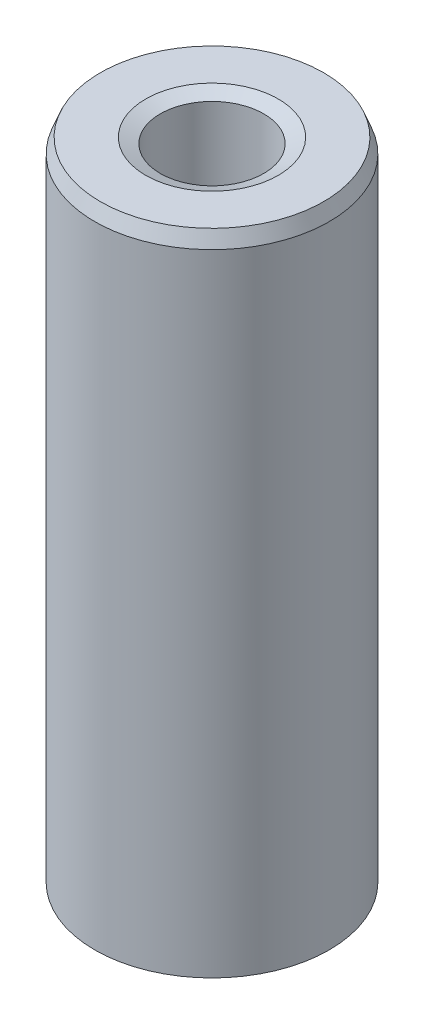
ISO-10303-21;
HEADER;
FILE_DESCRIPTION(('STEP AP214'),'2;1');
FILE_NAME('part.step','',(''),(''),'','','');
FILE_SCHEMA(('AUTOMOTIVE_DESIGN { 1 0 10303 214 1 1 1 1 }'));
ENDSEC;
DATA;
#1=APPLICATION_CONTEXT('core data for automotive mechanical design processes');
#2=APPLICATION_PROTOCOL_DEFINITION('international standard','automotive_design',2000,#1);
#3=PRODUCT_CONTEXT('',#1,'mechanical');
#4=PRODUCT('Part','Part','',(#3));
#5=PRODUCT_RELATED_PRODUCT_CATEGORY('part','',(#4));
#6=PRODUCT_DEFINITION_FORMATION('','',#4);
#7=PRODUCT_DEFINITION_CONTEXT('part definition',#1,'design');
#8=PRODUCT_DEFINITION('design','',#6,#7);
#9=PRODUCT_DEFINITION_SHAPE('','',#8);
#10=(LENGTH_UNIT() NAMED_UNIT(*) SI_UNIT(.MILLI.,.METRE.));
#11=(NAMED_UNIT(*) PLANE_ANGLE_UNIT() SI_UNIT($,.RADIAN.));
#12=(NAMED_UNIT(*) SI_UNIT($,.STERADIAN.) SOLID_ANGLE_UNIT());
#13=UNCERTAINTY_MEASURE_WITH_UNIT(LENGTH_MEASURE(1.E-05),#10,'distance_accuracy_value','');
#14=(GEOMETRIC_REPRESENTATION_CONTEXT(3) GLOBAL_UNCERTAINTY_ASSIGNED_CONTEXT((#13)) GLOBAL_UNIT_ASSIGNED_CONTEXT((#10,
#11,#12)) REPRESENTATION_CONTEXT('',''));
#15=CARTESIAN_POINT('',(0.,0.,0.));
#16=DIRECTION('',(0.,0.,1.));
#17=DIRECTION('',(1.,0.,0.));
#18=AXIS2_PLACEMENT_3D('',#15,#16,#17);
#19=CARTESIAN_POINT('',(0.,55.4875220967397,0.));
#20=DIRECTION('',(0.,-1.,0.));
#21=DIRECTION('',(0.,0.,-1.));
#22=AXIS2_PLACEMENT_3D('',#19,#20,#21);
#23=CYLINDRICAL_SURFACE('',#22,10.);
#24=CARTESIAN_POINT('',(0.,0.478369418327185,0.));
#25=DIRECTION('',(0.,1.,0.));
#26=DIRECTION('',(0.,0.,1.));
#27=AXIS2_PLACEMENT_3D('',#24,#25,#26);
#28=CIRCLE('',#27,10.);
#29=CARTESIAN_POINT('',(0.,0.478369418327178,-10.));
#30=VERTEX_POINT('',#29);
#31=EDGE_CURVE('E10',#30,#30,#28,.T.);
#32=CARTESIAN_POINT('',(0.,54.249934161855,0.));
#33=DIRECTION('',(0.,1.,0.));
#34=DIRECTION('',(0.,0.,1.));
#35=AXIS2_PLACEMENT_3D('',#32,#33,#34);
#36=CIRCLE('',#35,10.);
#37=CARTESIAN_POINT('',(0.,54.249934161855,-10.));
#38=VERTEX_POINT('',#37);
#39=EDGE_CURVE('E50',#38,#38,#36,.F.);
#40=CARTESIAN_POINT('',(0.,0.478369418327178,-10.));
#41=CARTESIAN_POINT('',(0.,1.03848988440559,-10.));
#42=CARTESIAN_POINT('',(0.,1.59861035048401,-10.));
#43=CARTESIAN_POINT('',(0.,2.71885128264084,-10.));
#44=CARTESIAN_POINT('',(0.,3.27897174871925,-10.));
#45=CARTESIAN_POINT('',(0.,4.39921268087608,-10.));
#46=CARTESIAN_POINT('',(0.,4.9593331469545,-10.));
#47=CARTESIAN_POINT('',(0.,6.07957407911133,-10.));
#48=CARTESIAN_POINT('',(0.,6.63969454518974,-10.));
#49=CARTESIAN_POINT('',(0.,7.75993547734657,-10.));
#50=CARTESIAN_POINT('',(0.,8.32005594342499,-10.));
#51=CARTESIAN_POINT('',(0.,9.44029687558182,-10.));
#52=CARTESIAN_POINT('',(0.,10.0004173416602,-10.));
#53=CARTESIAN_POINT('',(0.,11.1206582738171,-10.));
#54=CARTESIAN_POINT('',(0.,11.6807787398955,-10.));
#55=CARTESIAN_POINT('',(0.,12.8010196720523,-10.));
#56=CARTESIAN_POINT('',(0.,13.3611401381307,-10.));
#57=CARTESIAN_POINT('',(0.,14.4813810702876,-10.));
#58=CARTESIAN_POINT('',(0.,15.041501536366,-10.));
#59=CARTESIAN_POINT('',(0.,16.1617424685228,-10.));
#60=CARTESIAN_POINT('',(0.,16.7218629346012,-10.));
#61=CARTESIAN_POINT('',(0.,17.842103866758,-10.));
#62=CARTESIAN_POINT('',(0.,18.4022243328365,-10.));
#63=CARTESIAN_POINT('',(0.,19.5224652649933,-10.));
#64=CARTESIAN_POINT('',(0.,20.0825857310717,-10.));
#65=CARTESIAN_POINT('',(0.,21.2028266632285,-10.));
#66=CARTESIAN_POINT('',(0.,21.7629471293069,-10.));
#67=CARTESIAN_POINT('',(0.,22.8831880614638,-10.));
#68=CARTESIAN_POINT('',(0.,23.4433085275422,-10.));
#69=CARTESIAN_POINT('',(0.,24.563549459699,-10.));
#70=CARTESIAN_POINT('',(0.,25.1236699257774,-10.));
#71=CARTESIAN_POINT('',(0.,26.2439108579343,-10.));
#72=CARTESIAN_POINT('',(0.,26.8040313240127,-10.));
#73=CARTESIAN_POINT('',(0.,27.9242722561695,-10.));
#74=CARTESIAN_POINT('',(0.,28.4843927222479,-10.));
#75=CARTESIAN_POINT('',(0.,29.6046336544048,-10.));
#76=CARTESIAN_POINT('',(0.,30.1647541204832,-10.));
#77=CARTESIAN_POINT('',(0.,31.28499505264,-10.));
#78=CARTESIAN_POINT('',(0.,31.8451155187184,-10.));
#79=CARTESIAN_POINT('',(0.,32.9653564508752,-10.));
#80=CARTESIAN_POINT('',(0.,33.5254769169537,-10.));
#81=CARTESIAN_POINT('',(0.,34.6457178491105,-10.));
#82=CARTESIAN_POINT('',(0.,35.2058383151889,-10.));
#83=CARTESIAN_POINT('',(0.,36.3260792473457,-10.));
#84=CARTESIAN_POINT('',(0.,36.8861997134241,-10.));
#85=CARTESIAN_POINT('',(0.,38.006440645581,-10.));
#86=CARTESIAN_POINT('',(0.,38.5665611116594,-10.));
#87=CARTESIAN_POINT('',(0.,39.6868020438162,-10.));
#88=CARTESIAN_POINT('',(0.,40.2469225098946,-10.));
#89=CARTESIAN_POINT('',(0.,41.3671634420515,-10.));
#90=CARTESIAN_POINT('',(0.,41.9272839081299,-10.));
#91=CARTESIAN_POINT('',(0.,43.0475248402867,-10.));
#92=CARTESIAN_POINT('',(0.,43.6076453063651,-10.));
#93=CARTESIAN_POINT('',(0.,44.727886238522,-10.));
#94=CARTESIAN_POINT('',(0.,45.2880067046004,-10.));
#95=CARTESIAN_POINT('',(0.,46.4082476367572,-10.));
#96=CARTESIAN_POINT('',(0.,46.9683681028356,-10.));
#97=CARTESIAN_POINT('',(0.,48.0886090349924,-10.));
#98=CARTESIAN_POINT('',(0.,48.6487295010709,-10.));
#99=CARTESIAN_POINT('',(0.,49.7689704332277,-10.));
#100=CARTESIAN_POINT('',(0.,50.3290908993061,-10.));
#101=CARTESIAN_POINT('',(0.,51.4493318314629,-10.));
#102=CARTESIAN_POINT('',(0.,52.0094522975414,-10.));
#103=CARTESIAN_POINT('',(0.,53.1296932296982,-10.));
#104=CARTESIAN_POINT('',(0.,53.6898136957766,-10.));
#105=CARTESIAN_POINT('',(0.,54.249934161855,-10.));
#106=B_SPLINE_CURVE_WITH_KNOTS('',3,(#40,#41,#42,#43,#44,#45,#46,#47,#48,#49,#50,#51,#52,#53,
#54,#55,#56,#57,#58,#59,#60,#61,#62,#63,#64,#65,#66,#67,#68,#69,#70,#71,#72,#73,#74,#75,#76,#77,
#78,#79,#80,#81,#82,#83,#84,#85,#86,#87,#88,#89,#90,#91,#92,#93,#94,#95,#96,#97,#98,#99,#100,
#101,#102,#103,#104,#105),.UNSPECIFIED.,.F.,.F.,(4,2,2,2,2,2,2,2,2,2,2,2,2,2,2,2,2,2,2,2,2,2,2,
2,2,2,2,2,2,2,2,2,4),(0.,1.68036139823524,3.36072279647049,5.04108419470573,6.72144559294098,
8.40180699117622,10.0821683894115,11.7625297876467,13.442891185882,15.1232525841172,
16.8036139823524,18.4839753805877,20.1643367788229,21.8446981770582,23.5250595752934,
25.2054209735287,26.8857823717639,28.5661437699992,30.2465051682344,31.9268665664696,
33.6072279647049,35.2875893629401,36.9679507611754,38.6483121594106,40.3286735576459,
42.0090349558811,43.6893963541164,45.3697577523516,47.0501191505869,48.7304805488221,
50.4108419470573,52.0912033452926,53.7715647435278),.UNSPECIFIED.);
#107=EDGE_CURVE('BSEAM39',#30,#38,#106,.T.);
#108=ORIENTED_EDGE('',*,*,#31,.T.);
#109=ORIENTED_EDGE('',*,*,#39,.T.);
#110=ORIENTED_EDGE('',*,*,#107,.T.);
#111=ORIENTED_EDGE('',*,*,#107,.F.);
#112=EDGE_LOOP('',(#108,#110,#109,#111));
#113=FACE_BOUND('',#112,.T.);
#114=ADVANCED_FACE('F39',(#113),#23,.T.);
#115=CARTESIAN_POINT('',(0.,55.4875220967397,0.));
#116=DIRECTION('',(0.,1.,0.));
#117=DIRECTION('',(0.,0.,1.));
#118=AXIS2_PLACEMENT_3D('',#115,#116,#117);
#119=PLANE('',#118);
#120=CARTESIAN_POINT('',(0.,55.4875220967397,0.));
#121=DIRECTION('',(0.,1.,0.));
#122=DIRECTION('',(0.,0.,1.));
#123=AXIS2_PLACEMENT_3D('',#120,#121,#122);
#124=CIRCLE('',#123,5.64803780153089);
#125=CARTESIAN_POINT('',(0.,55.4875220967397,5.64803780153089));
#126=VERTEX_POINT('',#125);
#127=EDGE_CURVE('E58',#126,#126,#124,.F.);
#128=ORIENTED_EDGE('',*,*,#127,.T.);
#129=EDGE_LOOP('',(#128));
#130=FACE_BOUND('',#129,.T.);
#131=CARTESIAN_POINT('',(0.,55.4875220967397,0.));
#132=DIRECTION('',(0.,1.,0.));
#133=DIRECTION('',(0.,0.,1.));
#134=AXIS2_PLACEMENT_3D('',#131,#132,#133);
#135=CIRCLE('',#134,9.52163058167282);
#136=CARTESIAN_POINT('',(0.,55.4875220967397,-9.52163058167282));
#137=VERTEX_POINT('',#136);
#138=EDGE_CURVE('E61',#137,#137,#135,.T.);
#139=ORIENTED_EDGE('',*,*,#138,.T.);
#140=EDGE_LOOP('',(#139));
#141=FACE_BOUND('',#140,.T.);
#142=ADVANCED_FACE('F88',(#130,#141),#119,.T.);
#143=CARTESIAN_POINT('',(0.,0.,0.));
#144=DIRECTION('',(0.,1.,0.));
#145=DIRECTION('',(0.,0.,1.));
#146=AXIS2_PLACEMENT_3D('',#143,#144,#145);
#147=PLANE('',#146);
#148=CARTESIAN_POINT('',(0.,0.,0.));
#149=DIRECTION('',(0.,1.,0.));
#150=DIRECTION('',(0.,0.,1.));
#151=AXIS2_PLACEMENT_3D('',#148,#149,#150);
#152=CIRCLE('',#151,4.8888192849733);
#153=CARTESIAN_POINT('',(0.,0.,4.8888192849733));
#154=VERTEX_POINT('',#153);
#155=EDGE_CURVE('E51',#154,#154,#152,.T.);
#156=ORIENTED_EDGE('',*,*,#155,.T.);
#157=EDGE_LOOP('',(#156));
#158=FACE_BOUND('',#157,.T.);
#159=CARTESIAN_POINT('',(0.,0.,0.));
#160=DIRECTION('',(0.,1.,0.));
#161=DIRECTION('',(0.,0.,1.));
#162=AXIS2_PLACEMENT_3D('',#159,#160,#161);
#163=CIRCLE('',#162,8.76241206511526);
#164=CARTESIAN_POINT('',(0.,0.,8.76241206511526));
#165=VERTEX_POINT('',#164);
#166=EDGE_CURVE('E54',#165,#165,#163,.F.);
#167=ORIENTED_EDGE('',*,*,#166,.T.);
#168=EDGE_LOOP('',(#167));
#169=FACE_BOUND('',#168,.T.);
#170=ADVANCED_FACE('F83',(#158,#169),#147,.F.);
#171=CARTESIAN_POINT('',(0.,55.4875220967397,0.));
#172=DIRECTION('',(0.,-1.,0.));
#173=DIRECTION('',(0.,0.,-1.));
#174=AXIS2_PLACEMENT_3D('',#171,#172,#173);
#175=CYLINDRICAL_SURFACE('',#174,4.41044986664611);
#176=CARTESIAN_POINT('',(0.,55.0091526784125,0.));
#177=DIRECTION('',(0.,1.,0.));
#178=DIRECTION('',(0.,0.,1.));
#179=AXIS2_PLACEMENT_3D('',#176,#177,#178);
#180=CIRCLE('',#179,4.41044986664611);
#181=CARTESIAN_POINT('',(0.,55.0091526784125,4.41044986664611));
#182=VERTEX_POINT('',#181);
#183=EDGE_CURVE('E67',#182,#182,#180,.T.);
#184=ORIENTED_EDGE('',*,*,#183,.T.);
#185=EDGE_LOOP('',(#184));
#186=FACE_BOUND('',#185,.T.);
#187=CARTESIAN_POINT('',(0.,1.23758793488474,0.));
#188=DIRECTION('',(0.,1.,0.));
#189=DIRECTION('',(0.,0.,1.));
#190=AXIS2_PLACEMENT_3D('',#187,#188,#189);
#191=CIRCLE('',#190,4.41044986664611);
#192=CARTESIAN_POINT('',(0.,1.23758793488474,4.41044986664611));
#193=VERTEX_POINT('',#192);
#194=EDGE_CURVE('E69',#193,#193,#191,.F.);
#195=ORIENTED_EDGE('',*,*,#194,.T.);
#196=EDGE_LOOP('',(#195));
#197=FACE_BOUND('',#196,.T.);
#198=ADVANCED_FACE('F71',(#186,#197),#175,.F.);
#199=CARTESIAN_POINT('',(0.,55.0091526784125,0.));
#200=DIRECTION('',(0.,1.,0.));
#201=DIRECTION('',(0.,0.,1.));
#202=AXIS2_PLACEMENT_3D('',#199,#200,#201);
#203=CONICAL_SURFACE('',#202,4.41044986664611,1.20195247585437);
#204=ORIENTED_EDGE('',*,*,#127,.F.);
#205=EDGE_LOOP('',(#204));
#206=FACE_BOUND('',#205,.T.);
#207=ORIENTED_EDGE('',*,*,#183,.F.);
#208=EDGE_LOOP('',(#207));
#209=FACE_BOUND('',#208,.T.);
#210=ADVANCED_FACE('F77',(#206,#209),#203,.F.);
#211=CARTESIAN_POINT('',(0.,0.,0.));
#212=DIRECTION('',(0.,-1.,0.));
#213=DIRECTION('',(0.,0.,-1.));
#214=AXIS2_PLACEMENT_3D('',#211,#212,#213);
#215=CONICAL_SURFACE('',#214,4.8888192849733,0.368843850940531);
#216=ORIENTED_EDGE('',*,*,#194,.F.);
#217=EDGE_LOOP('',(#216));
#218=FACE_BOUND('',#217,.T.);
#219=ORIENTED_EDGE('',*,*,#155,.F.);
#220=EDGE_LOOP('',(#219));
#221=FACE_BOUND('',#220,.T.);
#222=ADVANCED_FACE('F73',(#218,#221),#215,.F.);
#223=CARTESIAN_POINT('',(0.,0.478369418327185,0.));
#224=DIRECTION('',(0.,1.,0.));
#225=DIRECTION('',(0.,0.,1.));
#226=AXIS2_PLACEMENT_3D('',#223,#224,#225);
#227=CONICAL_SURFACE('',#226,10.,1.20195247585437);
#228=ORIENTED_EDGE('',*,*,#166,.F.);
#229=EDGE_LOOP('',(#228));
#230=FACE_BOUND('',#229,.T.);
#231=ORIENTED_EDGE('',*,*,#31,.F.);
#232=EDGE_LOOP('',(#231));
#233=FACE_BOUND('',#232,.T.);
#234=ADVANCED_FACE('F76',(#230,#233),#227,.T.);
#235=CARTESIAN_POINT('',(0.,55.4875220967397,0.));
#236=DIRECTION('',(0.,-1.,0.));
#237=DIRECTION('',(0.,0.,-1.));
#238=AXIS2_PLACEMENT_3D('',#235,#236,#237);
#239=CONICAL_SURFACE('',#238,9.52163058167282,0.368843850940529);
#240=CARTESIAN_POINT('',(0.,54.249934161855,-10.));
#241=CARTESIAN_POINT('',(0.,54.2628257028434,-9.99501698522576));
#242=CARTESIAN_POINT('',(0.,54.2757172438318,-9.99003397045152));
#243=CARTESIAN_POINT('',(0.,54.3015003258085,-9.98006794090304));
#244=CARTESIAN_POINT('',(0.,54.3143918667969,-9.9750849261288));
#245=CARTESIAN_POINT('',(0.,54.3401749487737,-9.96511889658031));
#246=CARTESIAN_POINT('',(0.,54.3530664897621,-9.96013588180607));
#247=CARTESIAN_POINT('',(0.,54.3788495717388,-9.95016985225759));
#248=CARTESIAN_POINT('',(0.,54.3917411127272,-9.94518683748335));
#249=CARTESIAN_POINT('',(0.,54.417524194704,-9.93522080793486));
#250=CARTESIAN_POINT('',(0.,54.4304157356924,-9.93023779316062));
#251=CARTESIAN_POINT('',(0.,54.4561988176691,-9.92027176361214));
#252=CARTESIAN_POINT('',(0.,54.4690903586575,-9.9152887488379));
#253=CARTESIAN_POINT('',(0.,54.4948734406343,-9.90532271928942));
#254=CARTESIAN_POINT('',(0.,54.5077649816227,-9.90033970451517));
#255=CARTESIAN_POINT('',(0.,54.5335480635994,-9.89037367496669));
#256=CARTESIAN_POINT('',(0.,54.5464396045878,-9.88539066019245));
#257=CARTESIAN_POINT('',(0.,54.5722226865646,-9.87542463064397));
#258=CARTESIAN_POINT('',(0.,54.585114227553,-9.87044161586972));
#259=CARTESIAN_POINT('',(0.,54.6108973095297,-9.86047558632124));
#260=CARTESIAN_POINT('',(0.,54.6237888505181,-9.855492571547));
#261=CARTESIAN_POINT('',(0.,54.6495719324949,-9.84552654199852));
#262=CARTESIAN_POINT('',(0.,54.6624634734833,-9.84054352722428));
#263=CARTESIAN_POINT('',(0.,54.68824655546,-9.83057749767579));
#264=CARTESIAN_POINT('',(0.,54.7011380964484,-9.82559448290155));
#265=CARTESIAN_POINT('',(0.,54.7269211784252,-9.81562845335307));
#266=CARTESIAN_POINT('',(0.,54.7398127194135,-9.81064543857883));
#267=CARTESIAN_POINT('',(0.,54.7655958013903,-9.80067940903034));
#268=CARTESIAN_POINT('',(0.,54.7784873423787,-9.7956963942561));
#269=CARTESIAN_POINT('',(0.,54.8042704243555,-9.78573036470762));
#270=CARTESIAN_POINT('',(0.,54.8171619653438,-9.78074734993338));
#271=CARTESIAN_POINT('',(0.,54.8429450473206,-9.77078132038489));
#272=CARTESIAN_POINT('',(0.,54.855836588309,-9.76579830561065));
#273=CARTESIAN_POINT('',(0.,54.8816196702858,-9.75583227606217));
#274=CARTESIAN_POINT('',(0.,54.8945112112741,-9.75084926128793));
#275=CARTESIAN_POINT('',(0.,54.9202942932509,-9.74088323173945));
#276=CARTESIAN_POINT('',(0.,54.9331858342393,-9.7359002169652));
#277=CARTESIAN_POINT('',(0.,54.9589689162161,-9.72593418741672));
#278=CARTESIAN_POINT('',(0.,54.9718604572044,-9.72095117264248));
#279=CARTESIAN_POINT('',(0.,54.9976435391812,-9.710985143094));
#280=CARTESIAN_POINT('',(0.,55.0105350801696,-9.70600212831975));
#281=CARTESIAN_POINT('',(0.,55.0363181621463,-9.69603609877127));
#282=CARTESIAN_POINT('',(0.,55.0492097031347,-9.69105308399703));
#283=CARTESIAN_POINT('',(0.,55.0749927851115,-9.68108705444855));
#284=CARTESIAN_POINT('',(0.,55.0878843260999,-9.67610403967431));
#285=CARTESIAN_POINT('',(0.,55.1136674080766,-9.66613801012582));
#286=CARTESIAN_POINT('',(0.,55.126558949065,-9.66115499535158));
#287=CARTESIAN_POINT('',(0.,55.1523420310418,-9.6511889658031));
#288=CARTESIAN_POINT('',(0.,55.1652335720302,-9.64620595102886));
#289=CARTESIAN_POINT('',(0.,55.1910166540069,-9.63623992148037));
#290=CARTESIAN_POINT('',(0.,55.2039081949953,-9.63125690670613));
#291=CARTESIAN_POINT('',(0.,55.2296912769721,-9.62129087715765));
#292=CARTESIAN_POINT('',(0.,55.2425828179605,-9.61630786238341));
#293=CARTESIAN_POINT('',(0.,55.2683658999372,-9.60634183283493));
#294=CARTESIAN_POINT('',(0.,55.2812574409256,-9.60135881806068));
#295=CARTESIAN_POINT('',(0.,55.3070405229024,-9.5913927885122));
#296=CARTESIAN_POINT('',(0.,55.3199320638908,-9.58640977373796));
#297=CARTESIAN_POINT('',(0.,55.3457151458675,-9.57644374418948));
#298=CARTESIAN_POINT('',(0.,55.3586066868559,-9.57146072941523));
#299=CARTESIAN_POINT('',(0.,55.3843897688327,-9.56149469986675));
#300=CARTESIAN_POINT('',(0.,55.3972813098211,-9.55651168509251));
#301=CARTESIAN_POINT('',(0.,55.4230643917978,-9.54654565554403));
#302=CARTESIAN_POINT('',(0.,55.4359559327862,-9.54156264076978));
#303=CARTESIAN_POINT('',(0.,55.461739014763,-9.5315966112213));
#304=CARTESIAN_POINT('',(0.,55.4746305557514,-9.52661359644706));
#305=CARTESIAN_POINT('',(0.,55.4875220967397,-9.52163058167282));
#306=B_SPLINE_CURVE_WITH_KNOTS('',3,(#240,#241,#242,#243,#244,#245,#246,#247,#248,#249,#250,
#251,#252,#253,#254,#255,#256,#257,#258,#259,#260,#261,#262,#263,#264,#265,#266,#267,#268,#269,
#270,#271,#272,#273,#274,#275,#276,#277,#278,#279,#280,#281,#282,#283,#284,#285,#286,#287,#288,
#289,#290,#291,#292,#293,#294,#295,#296,#297,#298,#299,#300,#301,#302,#303,#304,#305),
.UNSPECIFIED.,.F.,.F.,(4,2,2,2,2,2,2,2,2,2,2,2,2,2,2,2,2,2,2,2,2,2,2,2,2,2,2,2,2,2,2,2,4),(0.,
0.0414632414031883,0.0829264828063767,0.124389724209565,0.165852965612753,0.207316207015942,
0.24877944841913,0.290242689822318,0.331705931225513,0.373169172628701,0.41463241403189,
0.456095655435078,0.497558896838267,0.539022138241455,0.580485379644643,0.621948621047831,
0.663411862451026,0.704875103854214,0.746338345257403,0.787801586660591,0.829264828063779,
0.870728069466968,0.912191310870156,0.953654552273344,0.995117793676539,1.03658103507973,
1.07804427648292,1.1195075178861,1.16097075928929,1.20243400069248,1.24389724209567,
1.28536048349886,1.32682372490205),.UNSPECIFIED.);
#307=EDGE_CURVE('BSEAM45',#38,#137,#306,.T.);
#308=ORIENTED_EDGE('',*,*,#39,.F.);
#309=ORIENTED_EDGE('',*,*,#138,.F.);
#310=ORIENTED_EDGE('',*,*,#307,.T.);
#311=ORIENTED_EDGE('',*,*,#307,.F.);
#312=EDGE_LOOP('',(#308,#310,#309,#311));
#313=FACE_BOUND('',#312,.T.);
#314=ADVANCED_FACE('F45',(#313),#239,.T.);
#315=CLOSED_SHELL('',(#114,#142,#170,#198,#210,#222,#234,#314));
#316=MANIFOLD_SOLID_BREP('B2',#315);
#317=ADVANCED_BREP_SHAPE_REPRESENTATION('',(#18,#316),#14);
#318=SHAPE_DEFINITION_REPRESENTATION(#9,#317);
ENDSEC;
END-ISO-10303-21;
